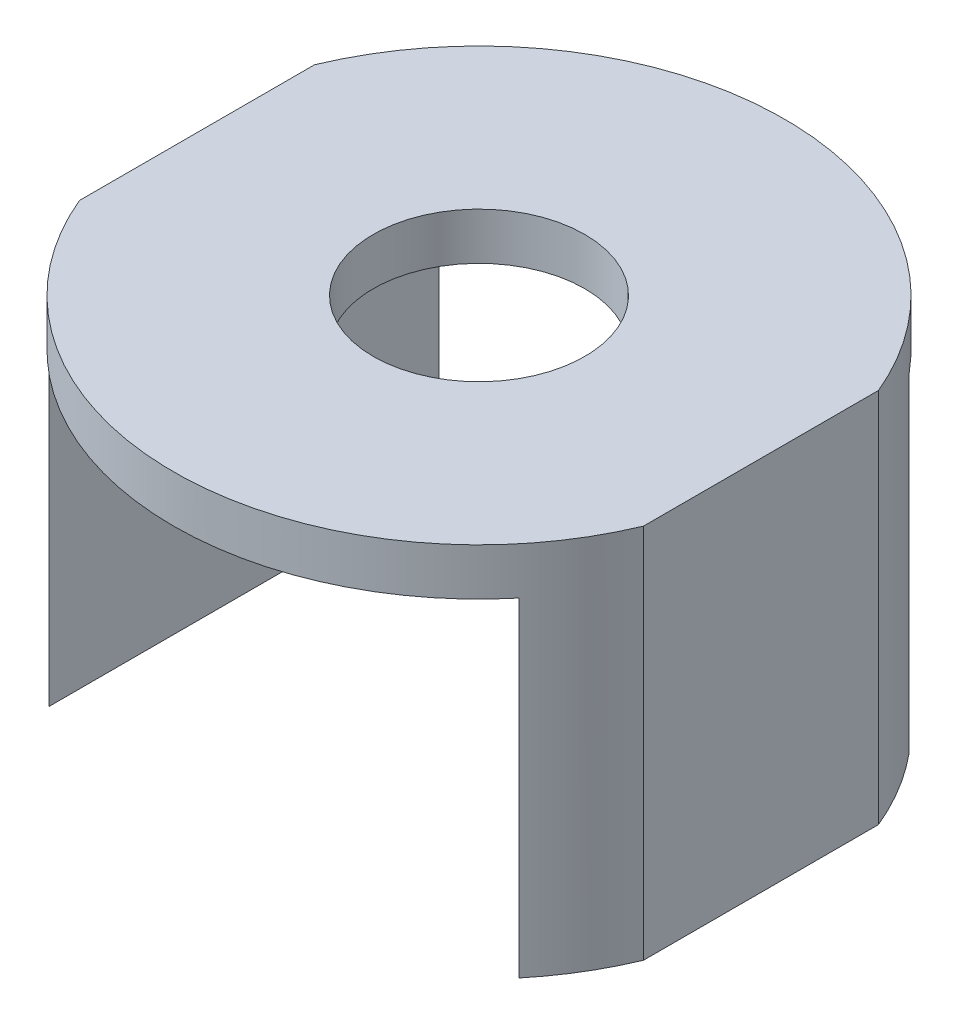
ISO-10303-21;
HEADER;
FILE_DESCRIPTION(('STEP AP214'),'2;1');
FILE_NAME('part.step','',(''),(''),'','','');
FILE_SCHEMA(('AUTOMOTIVE_DESIGN { 1 0 10303 214 1 1 1 1 }'));
ENDSEC;
DATA;
#1=APPLICATION_CONTEXT('core data for automotive mechanical design processes');
#2=APPLICATION_PROTOCOL_DEFINITION('international standard','automotive_design',2000,#1);
#3=PRODUCT_CONTEXT('',#1,'mechanical');
#4=PRODUCT('Part','Part','',(#3));
#5=PRODUCT_RELATED_PRODUCT_CATEGORY('part','',(#4));
#6=PRODUCT_DEFINITION_FORMATION('','',#4);
#7=PRODUCT_DEFINITION_CONTEXT('part definition',#1,'design');
#8=PRODUCT_DEFINITION('design','',#6,#7);
#9=PRODUCT_DEFINITION_SHAPE('','',#8);
#10=(LENGTH_UNIT() NAMED_UNIT(*) SI_UNIT(.MILLI.,.METRE.));
#11=(NAMED_UNIT(*) PLANE_ANGLE_UNIT() SI_UNIT($,.RADIAN.));
#12=(NAMED_UNIT(*) SI_UNIT($,.STERADIAN.) SOLID_ANGLE_UNIT());
#13=UNCERTAINTY_MEASURE_WITH_UNIT(LENGTH_MEASURE(1.E-05),#10,'distance_accuracy_value','');
#14=(GEOMETRIC_REPRESENTATION_CONTEXT(3) GLOBAL_UNCERTAINTY_ASSIGNED_CONTEXT((#13)) GLOBAL_UNIT_ASSIGNED_CONTEXT((#10,
#11,#12)) REPRESENTATION_CONTEXT('',''));
#15=CARTESIAN_POINT('',(0.,0.,0.));
#16=DIRECTION('',(0.,0.,1.));
#17=DIRECTION('',(1.,0.,0.));
#18=AXIS2_PLACEMENT_3D('',#15,#16,#17);
#19=CARTESIAN_POINT('',(-38.1,-25.4,114.3));
#20=DIRECTION('',(0.,1.,0.));
#21=DIRECTION('',(0.,0.,1.));
#22=AXIS2_PLACEMENT_3D('',#19,#20,#21);
#23=PLANE('',#22);
#24=CARTESIAN_POINT('',(0.,-25.4,57.15));
#25=DIRECTION('',(0.,1.,0.));
#26=DIRECTION('',(0.,0.,1.));
#27=AXIS2_PLACEMENT_3D('',#24,#25,#26);
#28=CIRCLE('',#27,41.275);
#29=CARTESIAN_POINT('',(31.75,-25.4,83.5235307647649));
#30=VERTEX_POINT('',#29);
#31=CARTESIAN_POINT('',(38.1,-25.4,73.025));
#32=VERTEX_POINT('',#31);
#33=EDGE_CURVE('E115',#30,#32,#28,.T.);
#34=ORIENTED_EDGE('',*,*,#33,.F.);
#35=DIRECTION('',(0.,0.,1.));
#36=VECTOR('',#35,1.);
#37=CARTESIAN_POINT('',(31.75,-25.4,6.34999999999999));
#38=LINE('',#37,#36);
#39=CARTESIAN_POINT('',(31.75,-25.4,30.7764692352351));
#40=VERTEX_POINT('',#39);
#41=EDGE_CURVE('E103',#40,#30,#38,.T.);
#42=ORIENTED_EDGE('',*,*,#41,.F.);
#43=CARTESIAN_POINT('',(0.,-25.4,57.15));
#44=DIRECTION('',(0.,1.,0.));
#45=DIRECTION('',(0.,0.,1.));
#46=AXIS2_PLACEMENT_3D('',#43,#44,#45);
#47=CIRCLE('',#46,41.275);
#48=CARTESIAN_POINT('',(38.1,-25.4,41.275));
#49=VERTEX_POINT('',#48);
#50=EDGE_CURVE('E113',#49,#40,#47,.T.);
#51=ORIENTED_EDGE('',*,*,#50,.F.);
#52=DIRECTION('',(0.,0.,-1.));
#53=VECTOR('',#52,1.);
#54=CARTESIAN_POINT('',(38.1,-25.4,114.3));
#55=LINE('',#54,#53);
#56=EDGE_CURVE('E150',#32,#49,#55,.T.);
#57=ORIENTED_EDGE('',*,*,#56,.F.);
#58=EDGE_LOOP('',(#34,#42,#51,#57));
#59=FACE_BOUND('',#58,.T.);
#60=ADVANCED_FACE('F35',(#59),#23,.F.);
#61=CARTESIAN_POINT('',(38.1,25.4,114.3));
#62=DIRECTION('',(-1.,0.,0.));
#63=DIRECTION('',(0.,0.,1.));
#64=AXIS2_PLACEMENT_3D('',#61,#62,#63);
#65=PLANE('',#64);
#66=DIRECTION('',(0.,1.,0.));
#67=VECTOR('',#66,1.);
#68=CARTESIAN_POINT('',(38.1,-88.9,41.275));
#69=LINE('',#68,#67);
#70=CARTESIAN_POINT('',(38.1,25.4,41.275));
#71=VERTEX_POINT('',#70);
#72=EDGE_CURVE('E57',#49,#71,#69,.T.);
#73=ORIENTED_EDGE('',*,*,#72,.T.);
#74=DIRECTION('',(0.,0.,-1.));
#75=VECTOR('',#74,1.);
#76=CARTESIAN_POINT('',(38.1,25.4,114.3));
#77=LINE('',#76,#75);
#78=CARTESIAN_POINT('',(38.1,25.4,73.025));
#79=VERTEX_POINT('',#78);
#80=EDGE_CURVE('E11',#79,#71,#77,.T.);
#81=ORIENTED_EDGE('',*,*,#80,.F.);
#82=DIRECTION('',(0.,1.,0.));
#83=VECTOR('',#82,1.);
#84=CARTESIAN_POINT('',(38.1,-88.9,73.025));
#85=LINE('',#84,#83);
#86=EDGE_CURVE('E132',#32,#79,#85,.T.);
#87=ORIENTED_EDGE('',*,*,#86,.F.);
#88=ORIENTED_EDGE('',*,*,#56,.T.);
#89=EDGE_LOOP('',(#73,#81,#87,#88));
#90=FACE_BOUND('',#89,.T.);
#91=ADVANCED_FACE('F37',(#90),#65,.F.);
#92=CARTESIAN_POINT('',(-38.1,25.4,114.3));
#93=DIRECTION('',(0.,-1.,0.));
#94=DIRECTION('',(0.,0.,-1.));
#95=AXIS2_PLACEMENT_3D('',#92,#93,#94);
#96=PLANE('',#95);
#97=CARTESIAN_POINT('',(0.,25.4,57.15));
#98=DIRECTION('',(0.,1.,0.));
#99=DIRECTION('',(0.,0.,1.));
#100=AXIS2_PLACEMENT_3D('',#97,#98,#99);
#101=CIRCLE('',#100,14.2875);
#102=CARTESIAN_POINT('',(0.,25.4,71.4375));
#103=VERTEX_POINT('',#102);
#104=EDGE_CURVE('E119',#103,#103,#101,.T.);
#105=ORIENTED_EDGE('',*,*,#104,.F.);
#106=EDGE_LOOP('',(#105));
#107=FACE_BOUND('',#106,.T.);
#108=CARTESIAN_POINT('',(0.,25.4,57.15));
#109=DIRECTION('',(0.,1.,0.));
#110=DIRECTION('',(0.,0.,1.));
#111=AXIS2_PLACEMENT_3D('',#108,#109,#110);
#112=CIRCLE('',#111,41.275);
#113=CARTESIAN_POINT('',(-38.1,25.4,41.275));
#114=VERTEX_POINT('',#113);
#115=EDGE_CURVE('E165',#71,#114,#112,.T.);
#116=ORIENTED_EDGE('',*,*,#115,.T.);
#117=DIRECTION('',(0.,0.,-1.));
#118=VECTOR('',#117,1.);
#119=CARTESIAN_POINT('',(-38.1,25.4,114.3));
#120=LINE('',#119,#118);
#121=CARTESIAN_POINT('',(-38.1,25.4,73.025));
#122=VERTEX_POINT('',#121);
#123=EDGE_CURVE('E43',#122,#114,#120,.T.);
#124=ORIENTED_EDGE('',*,*,#123,.F.);
#125=CARTESIAN_POINT('',(0.,25.4,57.15));
#126=DIRECTION('',(0.,1.,0.));
#127=DIRECTION('',(0.,0.,1.));
#128=AXIS2_PLACEMENT_3D('',#125,#126,#127);
#129=CIRCLE('',#128,41.275);
#130=EDGE_CURVE('E128',#122,#79,#129,.T.);
#131=ORIENTED_EDGE('',*,*,#130,.T.);
#132=ORIENTED_EDGE('',*,*,#80,.T.);
#133=EDGE_LOOP('',(#116,#124,#131,#132));
#134=FACE_BOUND('',#133,.T.);
#135=ADVANCED_FACE('F163',(#107,#134),#96,.F.);
#136=CARTESIAN_POINT('',(-38.1,25.4,114.3));
#137=DIRECTION('',(1.,0.,0.));
#138=DIRECTION('',(0.,1.,0.));
#139=AXIS2_PLACEMENT_3D('',#136,#137,#138);
#140=PLANE('',#139);
#141=DIRECTION('',(0.,1.,0.));
#142=VECTOR('',#141,1.);
#143=CARTESIAN_POINT('',(-38.1,-88.9,41.275));
#144=LINE('',#143,#142);
#145=CARTESIAN_POINT('',(-38.1,-25.4,41.275));
#146=VERTEX_POINT('',#145);
#147=EDGE_CURVE('E160',#146,#114,#144,.T.);
#148=ORIENTED_EDGE('',*,*,#147,.F.);
#149=DIRECTION('',(0.,0.,-1.));
#150=VECTOR('',#149,1.);
#151=CARTESIAN_POINT('',(-38.1,-25.4,114.3));
#152=LINE('',#151,#150);
#153=CARTESIAN_POINT('',(-38.1,-25.4,73.025));
#154=VERTEX_POINT('',#153);
#155=EDGE_CURVE('E152',#154,#146,#152,.T.);
#156=ORIENTED_EDGE('',*,*,#155,.F.);
#157=DIRECTION('',(0.,1.,0.));
#158=VECTOR('',#157,1.);
#159=CARTESIAN_POINT('',(-38.1,-88.9,73.025));
#160=LINE('',#159,#158);
#161=EDGE_CURVE('E131',#154,#122,#160,.T.);
#162=ORIENTED_EDGE('',*,*,#161,.T.);
#163=ORIENTED_EDGE('',*,*,#123,.T.);
#164=EDGE_LOOP('',(#148,#156,#162,#163));
#165=FACE_BOUND('',#164,.T.);
#166=ADVANCED_FACE('F158',(#165),#140,.F.);
#167=CARTESIAN_POINT('',(-31.75,-25.4,30.7764692352351));
#168=VERTEX_POINT('',#167);
#169=EDGE_CURVE('E108',#168,#146,#47,.T.);
#170=ORIENTED_EDGE('',*,*,#169,.F.);
#171=DIRECTION('',(0.,0.,-1.));
#172=VECTOR('',#171,1.);
#173=CARTESIAN_POINT('',(-31.75,-25.4,6.34999999999999));
#174=LINE('',#173,#172);
#175=CARTESIAN_POINT('',(-31.75,-25.4,83.5235307647649));
#176=VERTEX_POINT('',#175);
#177=EDGE_CURVE('E116',#176,#168,#174,.T.);
#178=ORIENTED_EDGE('',*,*,#177,.F.);
#179=EDGE_CURVE('E143',#154,#176,#28,.T.);
#180=ORIENTED_EDGE('',*,*,#179,.F.);
#181=ORIENTED_EDGE('',*,*,#155,.T.);
#182=EDGE_LOOP('',(#170,#178,#180,#181));
#183=FACE_BOUND('',#182,.T.);
#184=ADVANCED_FACE('F181',(#183),#23,.F.);
#185=CARTESIAN_POINT('',(31.75,19.05,114.3));
#186=DIRECTION('',(-1.,0.,0.));
#187=DIRECTION('',(0.,0.,1.));
#188=AXIS2_PLACEMENT_3D('',#185,#186,#187);
#189=PLANE('',#188);
#190=DIRECTION('',(0.,1.,0.));
#191=VECTOR('',#190,1.);
#192=CARTESIAN_POINT('',(31.75,-88.9,30.7764692352351));
#193=LINE('',#192,#191);
#194=CARTESIAN_POINT('',(31.75,19.05,30.7764692352351));
#195=VERTEX_POINT('',#194);
#196=EDGE_CURVE('E100',#195,#40,#193,.F.);
#197=ORIENTED_EDGE('',*,*,#196,.T.);
#198=ORIENTED_EDGE('',*,*,#41,.T.);
#199=DIRECTION('',(0.,1.,0.));
#200=VECTOR('',#199,1.);
#201=CARTESIAN_POINT('',(31.75,-88.9,83.5235307647649));
#202=LINE('',#201,#200);
#203=CARTESIAN_POINT('',(31.75,19.05,83.5235307647649));
#204=VERTEX_POINT('',#203);
#205=EDGE_CURVE('E141',#30,#204,#202,.T.);
#206=ORIENTED_EDGE('',*,*,#205,.T.);
#207=DIRECTION('',(0.,0.,-1.));
#208=VECTOR('',#207,1.);
#209=CARTESIAN_POINT('',(31.75,19.05,114.3));
#210=LINE('',#209,#208);
#211=EDGE_CURVE('E106',#204,#195,#210,.T.);
#212=ORIENTED_EDGE('',*,*,#211,.T.);
#213=EDGE_LOOP('',(#197,#198,#206,#212));
#214=FACE_BOUND('',#213,.T.);
#215=ADVANCED_FACE('F102',(#214),#189,.T.);
#216=CARTESIAN_POINT('',(-31.75,19.05,114.3));
#217=DIRECTION('',(0.,-1.,0.));
#218=DIRECTION('',(0.,0.,-1.));
#219=AXIS2_PLACEMENT_3D('',#216,#217,#218);
#220=PLANE('',#219);
#221=CARTESIAN_POINT('',(0.,19.05,57.15));
#222=DIRECTION('',(0.,-1.,0.));
#223=DIRECTION('',(0.,0.,-1.));
#224=AXIS2_PLACEMENT_3D('',#221,#222,#223);
#225=CIRCLE('',#224,14.2875);
#226=CARTESIAN_POINT('',(0.,19.05,42.8625));
#227=VERTEX_POINT('',#226);
#228=EDGE_CURVE('E122',#227,#227,#225,.T.);
#229=ORIENTED_EDGE('',*,*,#228,.F.);
#230=EDGE_LOOP('',(#229));
#231=FACE_BOUND('',#230,.T.);
#232=DIRECTION('',(0.,0.,-1.));
#233=VECTOR('',#232,1.);
#234=CARTESIAN_POINT('',(-31.75,19.05,114.3));
#235=LINE('',#234,#233);
#236=CARTESIAN_POINT('',(-31.75,19.05,83.5235307647648));
#237=VERTEX_POINT('',#236);
#238=CARTESIAN_POINT('',(-31.75,19.05,30.7764692352351));
#239=VERTEX_POINT('',#238);
#240=EDGE_CURVE('E146',#237,#239,#235,.T.);
#241=ORIENTED_EDGE('',*,*,#240,.T.);
#242=CARTESIAN_POINT('',(0.,19.05,57.15));
#243=DIRECTION('',(0.,-1.,0.));
#244=DIRECTION('',(0.,0.,-1.));
#245=AXIS2_PLACEMENT_3D('',#242,#243,#244);
#246=CIRCLE('',#245,41.275);
#247=EDGE_CURVE('E109',#239,#195,#246,.T.);
#248=ORIENTED_EDGE('',*,*,#247,.T.);
#249=ORIENTED_EDGE('',*,*,#211,.F.);
#250=CARTESIAN_POINT('',(0.,19.05,57.15));
#251=DIRECTION('',(0.,-1.,0.));
#252=DIRECTION('',(0.,0.,-1.));
#253=AXIS2_PLACEMENT_3D('',#250,#251,#252);
#254=CIRCLE('',#253,41.275);
#255=EDGE_CURVE('E138',#204,#237,#254,.T.);
#256=ORIENTED_EDGE('',*,*,#255,.T.);
#257=EDGE_LOOP('',(#241,#248,#249,#256));
#258=FACE_BOUND('',#257,.T.);
#259=ADVANCED_FACE('F172',(#231,#258),#220,.T.);
#260=CARTESIAN_POINT('',(-31.75,19.05,114.3));
#261=DIRECTION('',(1.,0.,0.));
#262=DIRECTION('',(0.,0.,-1.));
#263=AXIS2_PLACEMENT_3D('',#260,#261,#262);
#264=PLANE('',#263);
#265=DIRECTION('',(0.,1.,0.));
#266=VECTOR('',#265,1.);
#267=CARTESIAN_POINT('',(-31.75,-88.9,83.5235307647648));
#268=LINE('',#267,#266);
#269=EDGE_CURVE('E134',#237,#176,#268,.F.);
#270=ORIENTED_EDGE('',*,*,#269,.T.);
#271=ORIENTED_EDGE('',*,*,#177,.T.);
#272=DIRECTION('',(0.,1.,0.));
#273=VECTOR('',#272,1.);
#274=CARTESIAN_POINT('',(-31.75,-88.9,30.7764692352351));
#275=LINE('',#274,#273);
#276=EDGE_CURVE('E50',#168,#239,#275,.T.);
#277=ORIENTED_EDGE('',*,*,#276,.T.);
#278=ORIENTED_EDGE('',*,*,#240,.F.);
#279=EDGE_LOOP('',(#270,#271,#277,#278));
#280=FACE_BOUND('',#279,.T.);
#281=ADVANCED_FACE('F176',(#280),#264,.T.);
#282=CARTESIAN_POINT('',(0.,-88.9,57.15));
#283=DIRECTION('',(0.,1.,0.));
#284=DIRECTION('',(0.,0.,1.));
#285=AXIS2_PLACEMENT_3D('',#282,#283,#284);
#286=CYLINDRICAL_SURFACE('',#285,41.275);
#287=ORIENTED_EDGE('',*,*,#205,.F.);
#288=ORIENTED_EDGE('',*,*,#33,.T.);
#289=ORIENTED_EDGE('',*,*,#86,.T.);
#290=ORIENTED_EDGE('',*,*,#130,.F.);
#291=ORIENTED_EDGE('',*,*,#161,.F.);
#292=ORIENTED_EDGE('',*,*,#179,.T.);
#293=ORIENTED_EDGE('',*,*,#269,.F.);
#294=ORIENTED_EDGE('',*,*,#255,.F.);
#295=EDGE_LOOP('',(#287,#288,#289,#290,#291,#292,#293,#294));
#296=FACE_BOUND('',#295,.T.);
#297=ADVANCED_FACE('F183',(#296),#286,.T.);
#298=CARTESIAN_POINT('',(0.,-88.9,57.15));
#299=DIRECTION('',(0.,1.,0.));
#300=DIRECTION('',(0.,0.,1.));
#301=AXIS2_PLACEMENT_3D('',#298,#299,#300);
#302=CYLINDRICAL_SURFACE('',#301,14.2875);
#303=ORIENTED_EDGE('',*,*,#228,.T.);
#304=EDGE_LOOP('',(#303));
#305=FACE_BOUND('',#304,.T.);
#306=ORIENTED_EDGE('',*,*,#104,.T.);
#307=EDGE_LOOP('',(#306));
#308=FACE_BOUND('',#307,.T.);
#309=ADVANCED_FACE('F223',(#305,#308),#302,.F.);
#310=CARTESIAN_POINT('',(0.,-88.9,57.15));
#311=DIRECTION('',(0.,1.,0.));
#312=DIRECTION('',(0.,0.,1.));
#313=AXIS2_PLACEMENT_3D('',#310,#311,#312);
#314=CYLINDRICAL_SURFACE('',#313,41.275);
#315=ORIENTED_EDGE('',*,*,#50,.T.);
#316=ORIENTED_EDGE('',*,*,#196,.F.);
#317=ORIENTED_EDGE('',*,*,#247,.F.);
#318=ORIENTED_EDGE('',*,*,#276,.F.);
#319=ORIENTED_EDGE('',*,*,#169,.T.);
#320=ORIENTED_EDGE('',*,*,#147,.T.);
#321=ORIENTED_EDGE('',*,*,#115,.F.);
#322=ORIENTED_EDGE('',*,*,#72,.F.);
#323=EDGE_LOOP('',(#315,#316,#317,#318,#319,#320,#321,#322));
#324=FACE_BOUND('',#323,.T.);
#325=ADVANCED_FACE('F118',(#324),#314,.T.);
#326=CLOSED_SHELL('',(#60,#91,#135,#166,#184,#215,#259,#281,#297,#309,#325));
#327=MANIFOLD_SOLID_BREP('B2',#326);
#328=ADVANCED_BREP_SHAPE_REPRESENTATION('',(#18,#327),#14);
#329=SHAPE_DEFINITION_REPRESENTATION(#9,#328);
ENDSEC;
END-ISO-10303-21;
